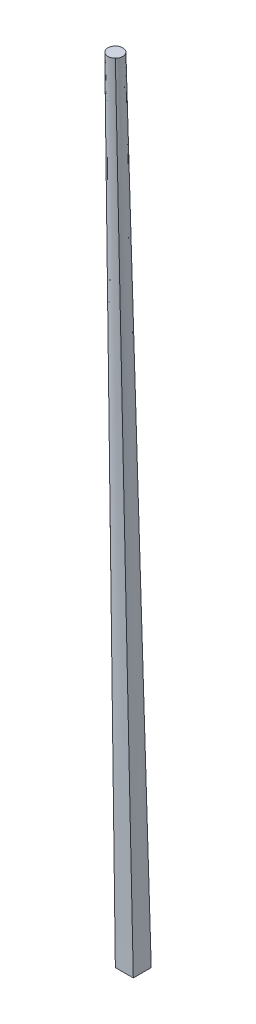
ISO-10303-21;
HEADER;
FILE_DESCRIPTION(('STEP AP214'),'2;1');
FILE_NAME('part.step','',(''),(''),'','','');
FILE_SCHEMA(('AUTOMOTIVE_DESIGN { 1 0 10303 214 1 1 1 1 }'));
ENDSEC;
DATA;
#1=APPLICATION_CONTEXT('core data for automotive mechanical design processes');
#2=APPLICATION_PROTOCOL_DEFINITION('international standard','automotive_design',2000,#1);
#3=PRODUCT_CONTEXT('',#1,'mechanical');
#4=PRODUCT('Part','Part','',(#3));
#5=PRODUCT_RELATED_PRODUCT_CATEGORY('part','',(#4));
#6=PRODUCT_DEFINITION_FORMATION('','',#4);
#7=PRODUCT_DEFINITION_CONTEXT('part definition',#1,'design');
#8=PRODUCT_DEFINITION('design','',#6,#7);
#9=PRODUCT_DEFINITION_SHAPE('','',#8);
#10=(LENGTH_UNIT() NAMED_UNIT(*) SI_UNIT(.MILLI.,.METRE.));
#11=(NAMED_UNIT(*) PLANE_ANGLE_UNIT() SI_UNIT($,.RADIAN.));
#12=(NAMED_UNIT(*) SI_UNIT($,.STERADIAN.) SOLID_ANGLE_UNIT());
#13=UNCERTAINTY_MEASURE_WITH_UNIT(LENGTH_MEASURE(1.E-05),#10,'distance_accuracy_value','');
#14=(GEOMETRIC_REPRESENTATION_CONTEXT(3) GLOBAL_UNCERTAINTY_ASSIGNED_CONTEXT((#13)) GLOBAL_UNIT_ASSIGNED_CONTEXT((#10,
#11,#12)) REPRESENTATION_CONTEXT('',''));
#15=CARTESIAN_POINT('',(0.,0.,0.));
#16=DIRECTION('',(0.,0.,1.));
#17=DIRECTION('',(1.,0.,0.));
#18=AXIS2_PLACEMENT_3D('',#15,#16,#17);
#19=CARTESIAN_POINT('',(0.,265.,0.));
#20=DIRECTION('',(0.,1.,0.));
#21=DIRECTION('',(0.,0.,1.));
#22=AXIS2_PLACEMENT_3D('',#19,#20,#21);
#23=PLANE('',#22);
#24=CARTESIAN_POINT('',(0.,265.,0.));
#25=DIRECTION('',(0.,1.,0.));
#26=DIRECTION('',(0.,0.,1.));
#27=AXIS2_PLACEMENT_3D('',#24,#25,#26);
#28=CIRCLE('',#27,2.5);
#29=CARTESIAN_POINT('',(-1.76776695296637,265.,-1.76776695296637));
#30=VERTEX_POINT('',#29);
#31=CARTESIAN_POINT('',(-1.76776695296637,265.,1.76776695296637));
#32=VERTEX_POINT('',#31);
#33=EDGE_CURVE('E12',#30,#32,#28,.T.);
#34=ORIENTED_EDGE('',*,*,#33,.T.);
#35=CARTESIAN_POINT('',(1.76776695296637,265.,1.76776695296637));
#36=VERTEX_POINT('',#35);
#37=EDGE_CURVE('E73',#32,#36,#28,.T.);
#38=ORIENTED_EDGE('',*,*,#37,.T.);
#39=CARTESIAN_POINT('',(1.76776695296637,265.,-1.76776695296637));
#40=VERTEX_POINT('',#39);
#41=EDGE_CURVE('E206',#36,#40,#28,.T.);
#42=ORIENTED_EDGE('',*,*,#41,.T.);
#43=EDGE_CURVE('E198',#40,#30,#28,.T.);
#44=ORIENTED_EDGE('',*,*,#43,.T.);
#45=EDGE_LOOP('',(#34,#38,#42,#44));
#46=FACE_BOUND('',#45,.T.);
#47=ADVANCED_FACE('F63',(#46),#23,.T.);
#48=CARTESIAN_POINT('',(0.,0.,0.));
#49=DIRECTION('',(0.,-1.,0.));
#50=DIRECTION('',(0.,0.,-1.));
#51=AXIS2_PLACEMENT_3D('',#48,#49,#50);
#52=PLANE('',#51);
#53=DIRECTION('',(0.,0.,1.));
#54=VECTOR('',#53,1.);
#55=CARTESIAN_POINT('',(0.,0.,0.));
#56=LINE('',#55,#54);
#57=CARTESIAN_POINT('',(0.,0.,-6.));
#58=VERTEX_POINT('',#57);
#59=CARTESIAN_POINT('',(0.,0.,0.));
#60=VERTEX_POINT('',#59);
#61=EDGE_CURVE('E111',#58,#60,#56,.T.);
#62=ORIENTED_EDGE('',*,*,#61,.F.);
#63=DIRECTION('',(-1.,0.,0.));
#64=VECTOR('',#63,1.);
#65=CARTESIAN_POINT('',(0.,0.,-6.));
#66=LINE('',#65,#64);
#67=CARTESIAN_POINT('',(6.,0.,-6.));
#68=VERTEX_POINT('',#67);
#69=EDGE_CURVE('E129',#68,#58,#66,.T.);
#70=ORIENTED_EDGE('',*,*,#69,.F.);
#71=DIRECTION('',(0.,0.,-1.));
#72=VECTOR('',#71,1.);
#73=CARTESIAN_POINT('',(6.,0.,0.));
#74=LINE('',#73,#72);
#75=CARTESIAN_POINT('',(6.,0.,0.));
#76=VERTEX_POINT('',#75);
#77=EDGE_CURVE('E113',#76,#68,#74,.T.);
#78=ORIENTED_EDGE('',*,*,#77,.F.);
#79=DIRECTION('',(1.,0.,0.));
#80=VECTOR('',#79,1.);
#81=CARTESIAN_POINT('',(0.,0.,0.));
#82=LINE('',#81,#80);
#83=EDGE_CURVE('E106',#60,#76,#82,.T.);
#84=ORIENTED_EDGE('',*,*,#83,.F.);
#85=EDGE_LOOP('',(#62,#70,#78,#84));
#86=FACE_BOUND('',#85,.T.);
#87=ADVANCED_FACE('F109',(#86),#52,.T.);
#88=CARTESIAN_POINT('',(0.,0.,0.));
#89=CARTESIAN_POINT('',(-1.76776695296637,265.,1.76776695296637));
#90=CARTESIAN_POINT('',(0.499999999999997,0.,0.));
#91=CARTESIAN_POINT('',(-1.55943361963304,265.,1.9761002862997));
#92=CARTESIAN_POINT('',(0.999999999999994,0.,0.));
#93=CARTESIAN_POINT('',(-1.29669860607481,265.,2.16289649052614));
#94=CARTESIAN_POINT('',(1.99999999999999,0.,0.));
#95=CARTESIAN_POINT('',(-0.689188131420544,265.,2.42581289947014));
#96=CARTESIAN_POINT('',(2.49999999999999,0.,0.));
#97=CARTESIAN_POINT('',(-0.345177968644246,265.,2.5));
#98=CARTESIAN_POINT('',(3.49999999999999,0.,0.));
#99=CARTESIAN_POINT('',(0.345177968644246,265.,2.5));
#100=CARTESIAN_POINT('',(3.99999999999999,0.,0.));
#101=CARTESIAN_POINT('',(0.689188131420543,265.,2.42581289947014));
#102=CARTESIAN_POINT('',(4.99999999999999,0.,0.));
#103=CARTESIAN_POINT('',(1.29669860607481,265.,2.16289649052614));
#104=CARTESIAN_POINT('',(5.5,0.,0.));
#105=CARTESIAN_POINT('',(1.55943361963304,265.,1.9761002862997));
#106=CARTESIAN_POINT('',(6.,0.,0.));
#107=CARTESIAN_POINT('',(1.76776695296637,265.,1.76776695296637));
#108=B_SPLINE_SURFACE_WITH_KNOTS('',3,1,((#88,#89),(#90,#91),(#92,#93),(#94,#95),(#96,#97),(#98,
#99),(#100,#101),(#102,#103),(#104,#105),(#106,#107)),.UNSPECIFIED.,.F.,.F.,.F.,(4,2,2,2,4),(2,
2),(0.,0.25,0.5,0.75,1.),(0.,1.),.UNSPECIFIED.);
#109=DIRECTION('',(-0.0159682991685325,0.999850252250887,0.00666981975035549));
#110=VECTOR('',#109,1.);
#111=CARTESIAN_POINT('',(3.88388347648318,132.5,0.883883476483184));
#112=LINE('',#111,#110);
#113=EDGE_CURVE('E135',#76,#36,#112,.T.);
#114=DIRECTION('',(0.00667052186000801,-0.99995550314813,-0.006670521860008));
#115=VECTOR('',#114,1.);
#116=CARTESIAN_POINT('',(-0.883883476483184,132.5,0.883883476483184));
#117=LINE('',#116,#115);
#118=EDGE_CURVE('E119',#32,#60,#117,.T.);
#119=ORIENTED_EDGE('',*,*,#83,.T.);
#120=ORIENTED_EDGE('',*,*,#113,.T.);
#121=ORIENTED_EDGE('',*,*,#37,.F.);
#122=ORIENTED_EDGE('',*,*,#118,.T.);
#123=EDGE_LOOP('',(#119,#120,#121,#122));
#124=FACE_BOUND('',#123,.T.);
#125=ADVANCED_FACE('F133',(#124),#108,.T.);
#126=CARTESIAN_POINT('',(6.,0.,0.));
#127=CARTESIAN_POINT('',(1.76776695296637,265.,1.76776695296637));
#128=CARTESIAN_POINT('',(6.,0.,-0.499999999999998));
#129=CARTESIAN_POINT('',(1.9761002862997,265.,1.55943361963304));
#130=CARTESIAN_POINT('',(6.,0.,-0.999999999999997));
#131=CARTESIAN_POINT('',(2.16289649052614,265.,1.29669860607481));
#132=CARTESIAN_POINT('',(6.,0.,-2.));
#133=CARTESIAN_POINT('',(2.42581289947014,265.,0.689188131420543));
#134=CARTESIAN_POINT('',(6.,0.,-2.49999999999999));
#135=CARTESIAN_POINT('',(2.5,265.,0.345177968644246));
#136=CARTESIAN_POINT('',(6.,0.,-3.49999999999999));
#137=CARTESIAN_POINT('',(2.5,265.,-0.345177968644246));
#138=CARTESIAN_POINT('',(6.,0.,-3.99999999999999));
#139=CARTESIAN_POINT('',(2.42581289947014,265.,-0.689188131420543));
#140=CARTESIAN_POINT('',(6.,0.,-5.));
#141=CARTESIAN_POINT('',(2.16289649052614,265.,-1.29669860607481));
#142=CARTESIAN_POINT('',(6.,0.,-5.5));
#143=CARTESIAN_POINT('',(1.9761002862997,265.,-1.55943361963303));
#144=CARTESIAN_POINT('',(6.,0.,-6.));
#145=CARTESIAN_POINT('',(1.76776695296637,265.,-1.76776695296637));
#146=B_SPLINE_SURFACE_WITH_KNOTS('',3,1,((#126,#127),(#128,#129),(#130,#131),(#132,#133),(#134,
#135),(#136,#137),(#138,#139),(#140,#141),(#142,#143),(#144,#145)),.UNSPECIFIED.,.F.,.F.,.F.,(4,
2,2,2,4),(2,2),(0.,0.25,0.5,0.75,1.),(0.,1.),.UNSPECIFIED.);
#147=DIRECTION('',(-0.0159666187696721,0.999745034581382,0.0159666187696721));
#148=VECTOR('',#147,1.);
#149=CARTESIAN_POINT('',(3.88388347648318,132.5,-3.88388347648318));
#150=LINE('',#149,#148);
#151=EDGE_CURVE('E137',#68,#40,#150,.T.);
#152=ORIENTED_EDGE('',*,*,#77,.T.);
#153=ORIENTED_EDGE('',*,*,#151,.T.);
#154=ORIENTED_EDGE('',*,*,#41,.F.);
#155=ORIENTED_EDGE('',*,*,#113,.F.);
#156=EDGE_LOOP('',(#152,#153,#154,#155));
#157=FACE_BOUND('',#156,.T.);
#158=ADVANCED_FACE('F157',(#157),#146,.T.);
#159=CARTESIAN_POINT('',(0.,0.,-6.));
#160=CARTESIAN_POINT('',(-1.76776695296637,265.,-1.76776695296637));
#161=CARTESIAN_POINT('',(0.,0.,-5.5));
#162=CARTESIAN_POINT('',(-1.9761002862997,265.,-1.55943361963304));
#163=CARTESIAN_POINT('',(0.,0.,-5.));
#164=CARTESIAN_POINT('',(-2.16289649052614,265.,-1.29669860607481));
#165=CARTESIAN_POINT('',(0.,0.,-4.));
#166=CARTESIAN_POINT('',(-2.42581289947014,265.,-0.689188131420544));
#167=CARTESIAN_POINT('',(0.,0.,-3.5));
#168=CARTESIAN_POINT('',(-2.5,265.,-0.345177968644246));
#169=CARTESIAN_POINT('',(0.,0.,-2.5));
#170=CARTESIAN_POINT('',(-2.5,265.,0.345177968644245));
#171=CARTESIAN_POINT('',(0.,0.,-2.));
#172=CARTESIAN_POINT('',(-2.42581289947014,265.,0.689188131420542));
#173=CARTESIAN_POINT('',(0.,0.,-1.));
#174=CARTESIAN_POINT('',(-2.16289649052614,265.,1.29669860607481));
#175=CARTESIAN_POINT('',(0.,0.,-0.500000000000001));
#176=CARTESIAN_POINT('',(-1.9761002862997,265.,1.55943361963303));
#177=CARTESIAN_POINT('',(0.,0.,0.));
#178=CARTESIAN_POINT('',(-1.76776695296637,265.,1.76776695296637));
#179=B_SPLINE_SURFACE_WITH_KNOTS('',3,1,((#159,#160),(#161,#162),(#163,#164),(#165,#166),(#167,
#168),(#169,#170),(#171,#172),(#173,#174),(#175,#176),(#177,#178)),.UNSPECIFIED.,.F.,.F.,.F.,(4,
2,2,2,4),(2,2),(0.,0.25,0.5,0.75,1.),(0.,1.),.UNSPECIFIED.);
#180=DIRECTION('',(-0.00666981975035549,0.999850252250887,0.0159682991685325));
#181=VECTOR('',#180,1.);
#182=CARTESIAN_POINT('',(-0.883883476483184,132.5,-3.88388347648318));
#183=LINE('',#182,#181);
#184=EDGE_CURVE('E128',#58,#30,#183,.T.);
#185=ORIENTED_EDGE('',*,*,#61,.T.);
#186=ORIENTED_EDGE('',*,*,#118,.F.);
#187=ORIENTED_EDGE('',*,*,#33,.F.);
#188=ORIENTED_EDGE('',*,*,#184,.F.);
#189=EDGE_LOOP('',(#185,#186,#187,#188));
#190=FACE_BOUND('',#189,.T.);
#191=ADVANCED_FACE('F127',(#190),#179,.T.);
#192=CARTESIAN_POINT('',(6.,0.,-6.));
#193=CARTESIAN_POINT('',(1.76776695296637,265.,-1.76776695296637));
#194=CARTESIAN_POINT('',(5.5,0.,-6.));
#195=CARTESIAN_POINT('',(1.55943361963304,265.,-1.9761002862997));
#196=CARTESIAN_POINT('',(5.,0.,-6.));
#197=CARTESIAN_POINT('',(1.29669860607481,265.,-2.16289649052614));
#198=CARTESIAN_POINT('',(4.,0.,-6.));
#199=CARTESIAN_POINT('',(0.689188131420543,265.,-2.42581289947014));
#200=CARTESIAN_POINT('',(3.5,0.,-6.));
#201=CARTESIAN_POINT('',(0.345177968644246,265.,-2.5));
#202=CARTESIAN_POINT('',(2.5,0.,-6.));
#203=CARTESIAN_POINT('',(-0.345177968644245,265.,-2.5));
#204=CARTESIAN_POINT('',(2.,0.,-6.));
#205=CARTESIAN_POINT('',(-0.689188131420543,265.,-2.42581289947014));
#206=CARTESIAN_POINT('',(1.,0.,-6.));
#207=CARTESIAN_POINT('',(-1.29669860607481,265.,-2.16289649052614));
#208=CARTESIAN_POINT('',(0.5,0.,-6.));
#209=CARTESIAN_POINT('',(-1.55943361963303,265.,-1.9761002862997));
#210=CARTESIAN_POINT('',(0.,0.,-6.));
#211=CARTESIAN_POINT('',(-1.76776695296637,265.,-1.76776695296637));
#212=B_SPLINE_SURFACE_WITH_KNOTS('',3,1,((#192,#193),(#194,#195),(#196,#197),(#198,#199),(#200,
#201),(#202,#203),(#204,#205),(#206,#207),(#208,#209),(#210,#211)),.UNSPECIFIED.,.F.,.F.,.F.,(4,
2,2,2,4),(2,2),(0.,0.25,0.5,0.75,1.),(0.,1.),.UNSPECIFIED.);
#213=ORIENTED_EDGE('',*,*,#69,.T.);
#214=ORIENTED_EDGE('',*,*,#184,.T.);
#215=ORIENTED_EDGE('',*,*,#43,.F.);
#216=ORIENTED_EDGE('',*,*,#151,.F.);
#217=EDGE_LOOP('',(#213,#214,#215,#216));
#218=FACE_BOUND('',#217,.T.);
#219=ADVANCED_FACE('F226',(#218),#212,.T.);
#220=CLOSED_SHELL('',(#47,#87,#125,#158,#191,#219));
#221=MANIFOLD_SOLID_BREP('B2',#220);
#222=ADVANCED_BREP_SHAPE_REPRESENTATION('',(#18,#221),#14);
#223=SHAPE_DEFINITION_REPRESENTATION(#9,#222);
ENDSEC;
END-ISO-10303-21;
